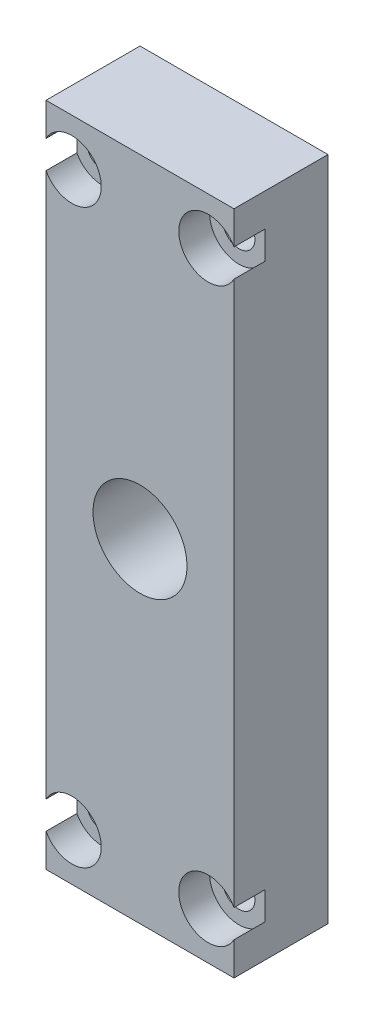
ISO-10303-21;
HEADER;
FILE_DESCRIPTION(('STEP AP214'),'2;1');
FILE_NAME('part.step','',(''),(''),'','','');
FILE_SCHEMA(('AUTOMOTIVE_DESIGN { 1 0 10303 214 1 1 1 1 }'));
ENDSEC;
DATA;
#1=APPLICATION_CONTEXT('core data for automotive mechanical design processes');
#2=APPLICATION_PROTOCOL_DEFINITION('international standard','automotive_design',2000,#1);
#3=PRODUCT_CONTEXT('',#1,'mechanical');
#4=PRODUCT('Part','Part','',(#3));
#5=PRODUCT_RELATED_PRODUCT_CATEGORY('part','',(#4));
#6=PRODUCT_DEFINITION_FORMATION('','',#4);
#7=PRODUCT_DEFINITION_CONTEXT('part definition',#1,'design');
#8=PRODUCT_DEFINITION('design','',#6,#7);
#9=PRODUCT_DEFINITION_SHAPE('','',#8);
#10=(LENGTH_UNIT() NAMED_UNIT(*) SI_UNIT(.MILLI.,.METRE.));
#11=(NAMED_UNIT(*) PLANE_ANGLE_UNIT() SI_UNIT($,.RADIAN.));
#12=(NAMED_UNIT(*) SI_UNIT($,.STERADIAN.) SOLID_ANGLE_UNIT());
#13=UNCERTAINTY_MEASURE_WITH_UNIT(LENGTH_MEASURE(1.E-05),#10,'distance_accuracy_value','');
#14=(GEOMETRIC_REPRESENTATION_CONTEXT(3) GLOBAL_UNCERTAINTY_ASSIGNED_CONTEXT((#13)) GLOBAL_UNIT_ASSIGNED_CONTEXT((#10,
#11,#12)) REPRESENTATION_CONTEXT('',''));
#15=CARTESIAN_POINT('',(0.,0.,0.));
#16=DIRECTION('',(0.,0.,1.));
#17=DIRECTION('',(1.,0.,0.));
#18=AXIS2_PLACEMENT_3D('',#15,#16,#17);
#19=CARTESIAN_POINT('',(0.,90.0176,0.));
#20=DIRECTION('',(0.,0.,-1.));
#21=DIRECTION('',(-1.,0.,0.));
#22=AXIS2_PLACEMENT_3D('',#19,#20,#21);
#23=PLANE('',#22);
#24=CARTESIAN_POINT('',(12.7,45.0127877133106,0.));
#25=DIRECTION('',(0.,0.,1.));
#26=DIRECTION('',(1.,0.,0.));
#27=AXIS2_PLACEMENT_3D('',#24,#25,#26);
#28=CIRCLE('',#27,6.35);
#29=CARTESIAN_POINT('',(19.05,45.0127877133106,0.));
#30=VERTEX_POINT('',#29);
#31=EDGE_CURVE('E241',#30,#30,#28,.T.);
#32=ORIENTED_EDGE('',*,*,#31,.F.);
#33=EDGE_LOOP('',(#32));
#34=FACE_BOUND('',#33,.T.);
#35=CARTESIAN_POINT('',(3.4925,6.35797542662115,0.));
#36=DIRECTION('',(0.,0.,1.));
#37=DIRECTION('',(1.,0.,0.));
#38=AXIS2_PLACEMENT_3D('',#35,#36,#37);
#39=CIRCLE('',#38,3.96875);
#40=CARTESIAN_POINT('',(0.,4.47292362030388,0.));
#41=VERTEX_POINT('',#40);
#42=CARTESIAN_POINT('',(0.,8.24302723293843,0.));
#43=VERTEX_POINT('',#42);
#44=EDGE_CURVE('E127',#41,#43,#39,.T.);
#45=ORIENTED_EDGE('',*,*,#44,.F.);
#46=DIRECTION('',(0.,-1.,0.));
#47=VECTOR('',#46,1.);
#48=CARTESIAN_POINT('',(0.,90.0176,0.));
#49=LINE('',#48,#47);
#50=CARTESIAN_POINT('',(0.,0.,0.));
#51=VERTEX_POINT('',#50);
#52=EDGE_CURVE('E188',#41,#51,#49,.T.);
#53=ORIENTED_EDGE('',*,*,#52,.T.);
#54=DIRECTION('',(1.,0.,0.));
#55=VECTOR('',#54,1.);
#56=CARTESIAN_POINT('',(0.,0.,0.));
#57=LINE('',#56,#55);
#58=CARTESIAN_POINT('',(25.4,0.,0.));
#59=VERTEX_POINT('',#58);
#60=EDGE_CURVE('E206',#51,#59,#57,.T.);
#61=ORIENTED_EDGE('',*,*,#60,.T.);
#62=DIRECTION('',(0.,-1.,0.));
#63=VECTOR('',#62,1.);
#64=CARTESIAN_POINT('',(25.4,90.0176,0.));
#65=LINE('',#64,#63);
#66=CARTESIAN_POINT('',(25.4,4.47292362030389,0.));
#67=VERTEX_POINT('',#66);
#68=EDGE_CURVE('E193',#67,#59,#65,.T.);
#69=ORIENTED_EDGE('',*,*,#68,.F.);
#70=CARTESIAN_POINT('',(21.9075,6.35797542662116,0.));
#71=DIRECTION('',(0.,0.,1.));
#72=DIRECTION('',(1.,0.,0.));
#73=AXIS2_PLACEMENT_3D('',#70,#71,#72);
#74=CIRCLE('',#73,3.96875);
#75=CARTESIAN_POINT('',(25.4,8.24302723293843,0.));
#76=VERTEX_POINT('',#75);
#77=EDGE_CURVE('E233',#76,#67,#74,.T.);
#78=ORIENTED_EDGE('',*,*,#77,.F.);
#79=CARTESIAN_POINT('',(25.4,81.7825481936827,0.));
#80=VERTEX_POINT('',#79);
#81=EDGE_CURVE('E192',#80,#76,#65,.T.);
#82=ORIENTED_EDGE('',*,*,#81,.F.);
#83=CARTESIAN_POINT('',(21.9075,83.6676,0.));
#84=DIRECTION('',(0.,0.,1.));
#85=DIRECTION('',(1.,0.,0.));
#86=AXIS2_PLACEMENT_3D('',#83,#84,#85);
#87=CIRCLE('',#86,3.96875);
#88=CARTESIAN_POINT('',(25.4,85.5526518063173,0.));
#89=VERTEX_POINT('',#88);
#90=EDGE_CURVE('E146',#89,#80,#87,.T.);
#91=ORIENTED_EDGE('',*,*,#90,.F.);
#92=CARTESIAN_POINT('',(25.4,90.0176,0.));
#93=VERTEX_POINT('',#92);
#94=EDGE_CURVE('E189',#93,#89,#65,.T.);
#95=ORIENTED_EDGE('',*,*,#94,.F.);
#96=DIRECTION('',(1.,0.,0.));
#97=VECTOR('',#96,1.);
#98=CARTESIAN_POINT('',(0.,90.0176,0.));
#99=LINE('',#98,#97);
#100=CARTESIAN_POINT('',(0.,90.0176,0.));
#101=VERTEX_POINT('',#100);
#102=EDGE_CURVE('E214',#101,#93,#99,.T.);
#103=ORIENTED_EDGE('',*,*,#102,.F.);
#104=CARTESIAN_POINT('',(0.,85.5526518063173,0.));
#105=VERTEX_POINT('',#104);
#106=EDGE_CURVE('E184',#101,#105,#49,.T.);
#107=ORIENTED_EDGE('',*,*,#106,.T.);
#108=CARTESIAN_POINT('',(3.4925,83.6676,0.));
#109=DIRECTION('',(0.,0.,1.));
#110=DIRECTION('',(1.,0.,0.));
#111=AXIS2_PLACEMENT_3D('',#108,#109,#110);
#112=CIRCLE('',#111,3.96875);
#113=CARTESIAN_POINT('',(0.,81.7825481936827,0.));
#114=VERTEX_POINT('',#113);
#115=EDGE_CURVE('E169',#114,#105,#112,.T.);
#116=ORIENTED_EDGE('',*,*,#115,.F.);
#117=EDGE_CURVE('E187',#114,#43,#49,.T.);
#118=ORIENTED_EDGE('',*,*,#117,.T.);
#119=EDGE_LOOP('',(#45,#53,#61,#69,#78,#82,#91,#95,#103,#107,#116,#118));
#120=FACE_BOUND('',#119,.T.);
#121=ADVANCED_FACE('F38',(#34,#120),#23,.F.);
#122=CARTESIAN_POINT('',(0.,90.0176,0.));
#123=DIRECTION('',(1.,0.,0.));
#124=DIRECTION('',(0.,0.,-1.));
#125=AXIS2_PLACEMENT_3D('',#122,#123,#124);
#126=PLANE('',#125);
#127=DIRECTION('',(0.,1.,0.));
#128=VECTOR('',#127,1.);
#129=CARTESIAN_POINT('',(0.,90.0176,-4.1656));
#130=LINE('',#129,#128);
#131=CARTESIAN_POINT('',(0.,4.47292362030388,-4.1656));
#132=VERTEX_POINT('',#131);
#133=CARTESIAN_POINT('',(0.,8.24302723293843,-4.1656));
#134=VERTEX_POINT('',#133);
#135=EDGE_CURVE('E47',#132,#134,#130,.T.);
#136=ORIENTED_EDGE('',*,*,#135,.T.);
#137=DIRECTION('',(0.,0.,1.));
#138=VECTOR('',#137,1.);
#139=CARTESIAN_POINT('',(0.,8.24302723293843,0.));
#140=LINE('',#139,#138);
#141=EDGE_CURVE('E11',#134,#43,#140,.T.);
#142=ORIENTED_EDGE('',*,*,#141,.T.);
#143=ORIENTED_EDGE('',*,*,#117,.F.);
#144=DIRECTION('',(0.,0.,1.));
#145=VECTOR('',#144,1.);
#146=CARTESIAN_POINT('',(0.,81.7825481936827,0.));
#147=LINE('',#146,#145);
#148=CARTESIAN_POINT('',(0.,81.7825481936827,-4.1656));
#149=VERTEX_POINT('',#148);
#150=EDGE_CURVE('E181',#114,#149,#147,.F.);
#151=ORIENTED_EDGE('',*,*,#150,.T.);
#152=DIRECTION('',(0.,1.,0.));
#153=VECTOR('',#152,1.);
#154=CARTESIAN_POINT('',(0.,90.0176,-4.1656));
#155=LINE('',#154,#153);
#156=CARTESIAN_POINT('',(0.,85.5526518063173,-4.1656));
#157=VERTEX_POINT('',#156);
#158=EDGE_CURVE('E178',#149,#157,#155,.T.);
#159=ORIENTED_EDGE('',*,*,#158,.T.);
#160=DIRECTION('',(0.,0.,1.));
#161=VECTOR('',#160,1.);
#162=CARTESIAN_POINT('',(0.,85.5526518063173,0.));
#163=LINE('',#162,#161);
#164=EDGE_CURVE('E165',#157,#105,#163,.T.);
#165=ORIENTED_EDGE('',*,*,#164,.T.);
#166=ORIENTED_EDGE('',*,*,#106,.F.);
#167=DIRECTION('',(0.,0.,1.));
#168=VECTOR('',#167,1.);
#169=CARTESIAN_POINT('',(0.,90.0176,0.));
#170=LINE('',#169,#168);
#171=CARTESIAN_POINT('',(0.,90.0176,-12.7));
#172=VERTEX_POINT('',#171);
#173=EDGE_CURVE('E203',#172,#101,#170,.T.);
#174=ORIENTED_EDGE('',*,*,#173,.F.);
#175=DIRECTION('',(0.,-1.,0.));
#176=VECTOR('',#175,1.);
#177=CARTESIAN_POINT('',(0.,90.0176,-12.7));
#178=LINE('',#177,#176);
#179=CARTESIAN_POINT('',(0.,0.,-12.7));
#180=VERTEX_POINT('',#179);
#181=EDGE_CURVE('E197',#172,#180,#178,.T.);
#182=ORIENTED_EDGE('',*,*,#181,.T.);
#183=DIRECTION('',(0.,0.,1.));
#184=VECTOR('',#183,1.);
#185=CARTESIAN_POINT('',(0.,0.,0.));
#186=LINE('',#185,#184);
#187=EDGE_CURVE('E174',#180,#51,#186,.T.);
#188=ORIENTED_EDGE('',*,*,#187,.T.);
#189=ORIENTED_EDGE('',*,*,#52,.F.);
#190=DIRECTION('',(0.,0.,1.));
#191=VECTOR('',#190,1.);
#192=CARTESIAN_POINT('',(0.,4.47292362030388,0.));
#193=LINE('',#192,#191);
#194=EDGE_CURVE('E138',#41,#132,#193,.F.);
#195=ORIENTED_EDGE('',*,*,#194,.T.);
#196=EDGE_LOOP('',(#136,#142,#143,#151,#159,#165,#166,#174,#182,#188,#189,#195));
#197=FACE_BOUND('',#196,.T.);
#198=ADVANCED_FACE('F40',(#197),#126,.F.);
#199=CARTESIAN_POINT('',(25.4,90.0176,0.));
#200=DIRECTION('',(-1.,0.,0.));
#201=DIRECTION('',(0.,0.,1.));
#202=AXIS2_PLACEMENT_3D('',#199,#200,#201);
#203=PLANE('',#202);
#204=DIRECTION('',(0.,-1.,0.));
#205=VECTOR('',#204,1.);
#206=CARTESIAN_POINT('',(25.4,90.0176,-4.1656));
#207=LINE('',#206,#205);
#208=CARTESIAN_POINT('',(25.4,8.24302723293843,-4.1656));
#209=VERTEX_POINT('',#208);
#210=CARTESIAN_POINT('',(25.4,4.47292362030389,-4.1656));
#211=VERTEX_POINT('',#210);
#212=EDGE_CURVE('E150',#209,#211,#207,.T.);
#213=ORIENTED_EDGE('',*,*,#212,.T.);
#214=DIRECTION('',(0.,0.,1.));
#215=VECTOR('',#214,1.);
#216=CARTESIAN_POINT('',(25.4,4.47292362030389,0.));
#217=LINE('',#216,#215);
#218=EDGE_CURVE('E140',#211,#67,#217,.T.);
#219=ORIENTED_EDGE('',*,*,#218,.T.);
#220=ORIENTED_EDGE('',*,*,#68,.T.);
#221=DIRECTION('',(0.,0.,-1.));
#222=VECTOR('',#221,1.);
#223=CARTESIAN_POINT('',(25.4,0.,0.));
#224=LINE('',#223,#222);
#225=CARTESIAN_POINT('',(25.4,0.,-12.7));
#226=VERTEX_POINT('',#225);
#227=EDGE_CURVE('E204',#59,#226,#224,.T.);
#228=ORIENTED_EDGE('',*,*,#227,.T.);
#229=DIRECTION('',(0.,-1.,0.));
#230=VECTOR('',#229,1.);
#231=CARTESIAN_POINT('',(25.4,90.0176,-12.7));
#232=LINE('',#231,#230);
#233=CARTESIAN_POINT('',(25.4,90.0176,-12.7));
#234=VERTEX_POINT('',#233);
#235=EDGE_CURVE('E194',#234,#226,#232,.T.);
#236=ORIENTED_EDGE('',*,*,#235,.F.);
#237=DIRECTION('',(0.,0.,-1.));
#238=VECTOR('',#237,1.);
#239=CARTESIAN_POINT('',(25.4,90.0176,0.));
#240=LINE('',#239,#238);
#241=EDGE_CURVE('E212',#93,#234,#240,.T.);
#242=ORIENTED_EDGE('',*,*,#241,.F.);
#243=ORIENTED_EDGE('',*,*,#94,.T.);
#244=DIRECTION('',(0.,0.,1.));
#245=VECTOR('',#244,1.);
#246=CARTESIAN_POINT('',(25.4,85.5526518063173,0.));
#247=LINE('',#246,#245);
#248=CARTESIAN_POINT('',(25.4,85.5526518063173,-4.1656));
#249=VERTEX_POINT('',#248);
#250=EDGE_CURVE('E162',#89,#249,#247,.F.);
#251=ORIENTED_EDGE('',*,*,#250,.T.);
#252=DIRECTION('',(0.,-1.,0.));
#253=VECTOR('',#252,1.);
#254=CARTESIAN_POINT('',(25.4,90.0176,-4.1656));
#255=LINE('',#254,#253);
#256=CARTESIAN_POINT('',(25.4,81.7825481936827,-4.1656));
#257=VERTEX_POINT('',#256);
#258=EDGE_CURVE('E159',#249,#257,#255,.T.);
#259=ORIENTED_EDGE('',*,*,#258,.T.);
#260=DIRECTION('',(0.,0.,1.));
#261=VECTOR('',#260,1.);
#262=CARTESIAN_POINT('',(25.4,81.7825481936827,0.));
#263=LINE('',#262,#261);
#264=EDGE_CURVE('E156',#257,#80,#263,.T.);
#265=ORIENTED_EDGE('',*,*,#264,.T.);
#266=ORIENTED_EDGE('',*,*,#81,.T.);
#267=DIRECTION('',(0.,0.,1.));
#268=VECTOR('',#267,1.);
#269=CARTESIAN_POINT('',(25.4,8.24302723293843,0.));
#270=LINE('',#269,#268);
#271=EDGE_CURVE('E153',#76,#209,#270,.F.);
#272=ORIENTED_EDGE('',*,*,#271,.T.);
#273=EDGE_LOOP('',(#213,#219,#220,#228,#236,#242,#243,#251,#259,#265,#266,#272));
#274=FACE_BOUND('',#273,.T.);
#275=ADVANCED_FACE('F264',(#274),#203,.F.);
#276=CARTESIAN_POINT('',(0.,90.0176,-12.7));
#277=DIRECTION('',(0.,0.,1.));
#278=DIRECTION('',(1.,0.,0.));
#279=AXIS2_PLACEMENT_3D('',#276,#277,#278);
#280=PLANE('',#279);
#281=CARTESIAN_POINT('',(12.7,45.0127877133106,-12.7));
#282=DIRECTION('',(0.,0.,1.));
#283=DIRECTION('',(1.,0.,0.));
#284=AXIS2_PLACEMENT_3D('',#281,#282,#283);
#285=CIRCLE('',#284,6.35);
#286=CARTESIAN_POINT('',(19.05,45.0127877133106,-12.7));
#287=VERTEX_POINT('',#286);
#288=EDGE_CURVE('E238',#287,#287,#285,.T.);
#289=ORIENTED_EDGE('',*,*,#288,.T.);
#290=EDGE_LOOP('',(#289));
#291=FACE_BOUND('',#290,.T.);
#292=CARTESIAN_POINT('',(3.4925,6.35797542662115,-12.7));
#293=DIRECTION('',(0.,0.,1.));
#294=DIRECTION('',(1.,0.,0.));
#295=AXIS2_PLACEMENT_3D('',#292,#293,#294);
#296=CIRCLE('',#295,2.15265);
#297=CARTESIAN_POINT('',(5.64514999999999,6.35797542662115,-12.7));
#298=VERTEX_POINT('',#297);
#299=EDGE_CURVE('E42',#298,#298,#296,.T.);
#300=ORIENTED_EDGE('',*,*,#299,.T.);
#301=EDGE_LOOP('',(#300));
#302=FACE_BOUND('',#301,.T.);
#303=CARTESIAN_POINT('',(21.9075,6.35797542662116,-12.7));
#304=DIRECTION('',(0.,0.,1.));
#305=DIRECTION('',(1.,0.,0.));
#306=AXIS2_PLACEMENT_3D('',#303,#304,#305);
#307=CIRCLE('',#306,2.15265);
#308=CARTESIAN_POINT('',(24.06015,6.35797542662116,-12.7));
#309=VERTEX_POINT('',#308);
#310=EDGE_CURVE('E143',#309,#309,#307,.T.);
#311=ORIENTED_EDGE('',*,*,#310,.T.);
#312=EDGE_LOOP('',(#311));
#313=FACE_BOUND('',#312,.T.);
#314=CARTESIAN_POINT('',(21.9075,83.6676,-12.7));
#315=DIRECTION('',(0.,0.,1.));
#316=DIRECTION('',(1.,0.,0.));
#317=AXIS2_PLACEMENT_3D('',#314,#315,#316);
#318=CIRCLE('',#317,2.15265);
#319=CARTESIAN_POINT('',(24.06015,83.6676,-12.7));
#320=VERTEX_POINT('',#319);
#321=EDGE_CURVE('E166',#320,#320,#318,.T.);
#322=ORIENTED_EDGE('',*,*,#321,.T.);
#323=EDGE_LOOP('',(#322));
#324=FACE_BOUND('',#323,.T.);
#325=CARTESIAN_POINT('',(3.4925,83.6676,-12.7));
#326=DIRECTION('',(0.,0.,1.));
#327=DIRECTION('',(1.,0.,0.));
#328=AXIS2_PLACEMENT_3D('',#325,#326,#327);
#329=CIRCLE('',#328,2.15265);
#330=CARTESIAN_POINT('',(5.64515,83.6676,-12.7));
#331=VERTEX_POINT('',#330);
#332=EDGE_CURVE('E171',#331,#331,#329,.T.);
#333=ORIENTED_EDGE('',*,*,#332,.T.);
#334=EDGE_LOOP('',(#333));
#335=FACE_BOUND('',#334,.T.);
#336=DIRECTION('',(-1.,0.,0.));
#337=VECTOR('',#336,1.);
#338=CARTESIAN_POINT('',(0.,0.,-12.7));
#339=LINE('',#338,#337);
#340=EDGE_CURVE('E201',#226,#180,#339,.T.);
#341=ORIENTED_EDGE('',*,*,#340,.T.);
#342=ORIENTED_EDGE('',*,*,#181,.F.);
#343=DIRECTION('',(-1.,0.,0.));
#344=VECTOR('',#343,1.);
#345=CARTESIAN_POINT('',(0.,90.0176,-12.7));
#346=LINE('',#345,#344);
#347=EDGE_CURVE('E200',#234,#172,#346,.T.);
#348=ORIENTED_EDGE('',*,*,#347,.F.);
#349=ORIENTED_EDGE('',*,*,#235,.T.);
#350=EDGE_LOOP('',(#341,#342,#348,#349));
#351=FACE_BOUND('',#350,.T.);
#352=ADVANCED_FACE('F295',(#291,#302,#313,#324,#335,#351),#280,.F.);
#353=CARTESIAN_POINT('',(0.,90.0176,0.));
#354=DIRECTION('',(0.,-1.,0.));
#355=DIRECTION('',(0.,0.,-1.));
#356=AXIS2_PLACEMENT_3D('',#353,#354,#355);
#357=PLANE('',#356);
#358=ORIENTED_EDGE('',*,*,#173,.T.);
#359=ORIENTED_EDGE('',*,*,#102,.T.);
#360=ORIENTED_EDGE('',*,*,#241,.T.);
#361=ORIENTED_EDGE('',*,*,#347,.T.);
#362=EDGE_LOOP('',(#358,#359,#360,#361));
#363=FACE_BOUND('',#362,.T.);
#364=ADVANCED_FACE('F272',(#363),#357,.F.);
#365=CARTESIAN_POINT('',(0.,0.,0.));
#366=DIRECTION('',(0.,-1.,0.));
#367=DIRECTION('',(0.,0.,-1.));
#368=AXIS2_PLACEMENT_3D('',#365,#366,#367);
#369=PLANE('',#368);
#370=ORIENTED_EDGE('',*,*,#187,.F.);
#371=ORIENTED_EDGE('',*,*,#340,.F.);
#372=ORIENTED_EDGE('',*,*,#227,.F.);
#373=ORIENTED_EDGE('',*,*,#60,.F.);
#374=EDGE_LOOP('',(#370,#371,#372,#373));
#375=FACE_BOUND('',#374,.T.);
#376=ADVANCED_FACE('F257',(#375),#369,.T.);
#377=CARTESIAN_POINT('',(5.64515,83.6676,-4.1656));
#378=DIRECTION('',(0.,0.,-1.));
#379=DIRECTION('',(-1.,0.,0.));
#380=AXIS2_PLACEMENT_3D('',#377,#378,#379);
#381=PLANE('',#380);
#382=CARTESIAN_POINT('',(3.4925,83.6676,-4.1656));
#383=DIRECTION('',(0.,0.,1.));
#384=DIRECTION('',(1.,0.,0.));
#385=AXIS2_PLACEMENT_3D('',#382,#383,#384);
#386=CIRCLE('',#385,2.15265);
#387=CARTESIAN_POINT('',(5.64515,83.6676,-4.1656));
#388=VERTEX_POINT('',#387);
#389=EDGE_CURVE('E175',#388,#388,#386,.T.);
#390=ORIENTED_EDGE('',*,*,#389,.F.);
#391=EDGE_LOOP('',(#390));
#392=FACE_BOUND('',#391,.T.);
#393=CARTESIAN_POINT('',(3.4925,83.6676,-4.1656));
#394=DIRECTION('',(0.,0.,1.));
#395=DIRECTION('',(1.,0.,0.));
#396=AXIS2_PLACEMENT_3D('',#393,#394,#395);
#397=CIRCLE('',#396,3.96875);
#398=EDGE_CURVE('E220',#149,#157,#397,.T.);
#399=ORIENTED_EDGE('',*,*,#398,.T.);
#400=ORIENTED_EDGE('',*,*,#158,.F.);
#401=EDGE_LOOP('',(#399,#400));
#402=FACE_BOUND('',#401,.T.);
#403=ADVANCED_FACE('F278',(#392,#402),#381,.F.);
#404=CARTESIAN_POINT('',(3.4925,83.6676,0.));
#405=DIRECTION('',(0.,0.,1.));
#406=DIRECTION('',(1.,0.,0.));
#407=AXIS2_PLACEMENT_3D('',#404,#405,#406);
#408=CYLINDRICAL_SURFACE('',#407,2.15265);
#409=ORIENTED_EDGE('',*,*,#389,.T.);
#410=EDGE_LOOP('',(#409));
#411=FACE_BOUND('',#410,.T.);
#412=ORIENTED_EDGE('',*,*,#332,.F.);
#413=EDGE_LOOP('',(#412));
#414=FACE_BOUND('',#413,.T.);
#415=ADVANCED_FACE('F280',(#411,#414),#408,.F.);
#416=CARTESIAN_POINT('',(3.4925,83.6676,0.));
#417=DIRECTION('',(0.,0.,1.));
#418=DIRECTION('',(1.,0.,0.));
#419=AXIS2_PLACEMENT_3D('',#416,#417,#418);
#420=CYLINDRICAL_SURFACE('',#419,3.96875);
#421=ORIENTED_EDGE('',*,*,#398,.F.);
#422=ORIENTED_EDGE('',*,*,#150,.F.);
#423=ORIENTED_EDGE('',*,*,#115,.T.);
#424=ORIENTED_EDGE('',*,*,#164,.F.);
#425=EDGE_LOOP('',(#421,#422,#423,#424));
#426=FACE_BOUND('',#425,.T.);
#427=ADVANCED_FACE('F276',(#426),#420,.F.);
#428=CARTESIAN_POINT('',(24.06015,83.6676,-4.1656));
#429=DIRECTION('',(0.,0.,-1.));
#430=DIRECTION('',(-1.,0.,0.));
#431=AXIS2_PLACEMENT_3D('',#428,#429,#430);
#432=PLANE('',#431);
#433=CARTESIAN_POINT('',(21.9075,83.6676,-4.1656));
#434=DIRECTION('',(0.,0.,1.));
#435=DIRECTION('',(1.,0.,0.));
#436=AXIS2_PLACEMENT_3D('',#433,#434,#435);
#437=CIRCLE('',#436,2.15265);
#438=CARTESIAN_POINT('',(24.06015,83.6676,-4.1656));
#439=VERTEX_POINT('',#438);
#440=EDGE_CURVE('E170',#439,#439,#437,.T.);
#441=ORIENTED_EDGE('',*,*,#440,.F.);
#442=EDGE_LOOP('',(#441));
#443=FACE_BOUND('',#442,.T.);
#444=CARTESIAN_POINT('',(21.9075,83.6676,-4.1656));
#445=DIRECTION('',(0.,0.,1.));
#446=DIRECTION('',(1.,0.,0.));
#447=AXIS2_PLACEMENT_3D('',#444,#445,#446);
#448=CIRCLE('',#447,3.96875);
#449=EDGE_CURVE('E226',#249,#257,#448,.T.);
#450=ORIENTED_EDGE('',*,*,#449,.T.);
#451=ORIENTED_EDGE('',*,*,#258,.F.);
#452=EDGE_LOOP('',(#450,#451));
#453=FACE_BOUND('',#452,.T.);
#454=ADVANCED_FACE('F389',(#443,#453),#432,.F.);
#455=CARTESIAN_POINT('',(21.9075,83.6676,0.));
#456=DIRECTION('',(0.,0.,1.));
#457=DIRECTION('',(1.,0.,0.));
#458=AXIS2_PLACEMENT_3D('',#455,#456,#457);
#459=CYLINDRICAL_SURFACE('',#458,3.96875);
#460=ORIENTED_EDGE('',*,*,#449,.F.);
#461=ORIENTED_EDGE('',*,*,#250,.F.);
#462=ORIENTED_EDGE('',*,*,#90,.T.);
#463=ORIENTED_EDGE('',*,*,#264,.F.);
#464=EDGE_LOOP('',(#460,#461,#462,#463));
#465=FACE_BOUND('',#464,.T.);
#466=ADVANCED_FACE('F382',(#465),#459,.F.);
#467=CARTESIAN_POINT('',(21.9075,83.6676,0.));
#468=DIRECTION('',(0.,0.,1.));
#469=DIRECTION('',(1.,0.,0.));
#470=AXIS2_PLACEMENT_3D('',#467,#468,#469);
#471=CYLINDRICAL_SURFACE('',#470,2.15265);
#472=ORIENTED_EDGE('',*,*,#440,.T.);
#473=EDGE_LOOP('',(#472));
#474=FACE_BOUND('',#473,.T.);
#475=ORIENTED_EDGE('',*,*,#321,.F.);
#476=EDGE_LOOP('',(#475));
#477=FACE_BOUND('',#476,.T.);
#478=ADVANCED_FACE('F374',(#474,#477),#471,.F.);
#479=CARTESIAN_POINT('',(21.9075,6.35797542662116,0.));
#480=DIRECTION('',(0.,0.,1.));
#481=DIRECTION('',(1.,0.,0.));
#482=AXIS2_PLACEMENT_3D('',#479,#480,#481);
#483=CYLINDRICAL_SURFACE('',#482,2.15265);
#484=CARTESIAN_POINT('',(21.9075,6.35797542662116,-4.1656));
#485=DIRECTION('',(0.,0.,1.));
#486=DIRECTION('',(1.,0.,0.));
#487=AXIS2_PLACEMENT_3D('',#484,#485,#486);
#488=CIRCLE('',#487,2.15265);
#489=CARTESIAN_POINT('',(24.06015,6.35797542662116,-4.1656));
#490=VERTEX_POINT('',#489);
#491=EDGE_CURVE('E147',#490,#490,#488,.T.);
#492=ORIENTED_EDGE('',*,*,#491,.T.);
#493=EDGE_LOOP('',(#492));
#494=FACE_BOUND('',#493,.T.);
#495=ORIENTED_EDGE('',*,*,#310,.F.);
#496=EDGE_LOOP('',(#495));
#497=FACE_BOUND('',#496,.T.);
#498=ADVANCED_FACE('F366',(#494,#497),#483,.F.);
#499=CARTESIAN_POINT('',(24.06015,6.35797542662116,-4.1656));
#500=DIRECTION('',(0.,0.,-1.));
#501=DIRECTION('',(-1.,0.,0.));
#502=AXIS2_PLACEMENT_3D('',#499,#500,#501);
#503=PLANE('',#502);
#504=ORIENTED_EDGE('',*,*,#491,.F.);
#505=EDGE_LOOP('',(#504));
#506=FACE_BOUND('',#505,.T.);
#507=CARTESIAN_POINT('',(21.9075,6.35797542662116,-4.1656));
#508=DIRECTION('',(0.,0.,1.));
#509=DIRECTION('',(1.,0.,0.));
#510=AXIS2_PLACEMENT_3D('',#507,#508,#509);
#511=CIRCLE('',#510,3.96875);
#512=EDGE_CURVE('E62',#209,#211,#511,.T.);
#513=ORIENTED_EDGE('',*,*,#512,.T.);
#514=ORIENTED_EDGE('',*,*,#212,.F.);
#515=EDGE_LOOP('',(#513,#514));
#516=FACE_BOUND('',#515,.T.);
#517=ADVANCED_FACE('F359',(#506,#516),#503,.F.);
#518=CARTESIAN_POINT('',(21.9075,6.35797542662116,0.));
#519=DIRECTION('',(0.,0.,1.));
#520=DIRECTION('',(1.,0.,0.));
#521=AXIS2_PLACEMENT_3D('',#518,#519,#520);
#522=CYLINDRICAL_SURFACE('',#521,3.96875);
#523=ORIENTED_EDGE('',*,*,#512,.F.);
#524=ORIENTED_EDGE('',*,*,#271,.F.);
#525=ORIENTED_EDGE('',*,*,#77,.T.);
#526=ORIENTED_EDGE('',*,*,#218,.F.);
#527=EDGE_LOOP('',(#523,#524,#525,#526));
#528=FACE_BOUND('',#527,.T.);
#529=ADVANCED_FACE('F351',(#528),#522,.F.);
#530=CARTESIAN_POINT('',(5.64514999999999,6.35797542662115,-4.1656));
#531=DIRECTION('',(0.,0.,-1.));
#532=DIRECTION('',(-1.,0.,0.));
#533=AXIS2_PLACEMENT_3D('',#530,#531,#532);
#534=PLANE('',#533);
#535=CARTESIAN_POINT('',(3.4925,6.35797542662115,-4.1656));
#536=DIRECTION('',(0.,0.,1.));
#537=DIRECTION('',(1.,0.,0.));
#538=AXIS2_PLACEMENT_3D('',#535,#536,#537);
#539=CIRCLE('',#538,2.15265);
#540=CARTESIAN_POINT('',(5.64514999999999,6.35797542662115,-4.1656));
#541=VERTEX_POINT('',#540);
#542=EDGE_CURVE('E135',#541,#541,#539,.T.);
#543=ORIENTED_EDGE('',*,*,#542,.F.);
#544=EDGE_LOOP('',(#543));
#545=FACE_BOUND('',#544,.T.);
#546=CARTESIAN_POINT('',(3.4925,6.35797542662115,-4.1656));
#547=DIRECTION('',(0.,0.,1.));
#548=DIRECTION('',(1.,0.,0.));
#549=AXIS2_PLACEMENT_3D('',#546,#547,#548);
#550=CIRCLE('',#549,3.96875);
#551=EDGE_CURVE('E54',#132,#134,#550,.T.);
#552=ORIENTED_EDGE('',*,*,#551,.T.);
#553=ORIENTED_EDGE('',*,*,#135,.F.);
#554=EDGE_LOOP('',(#552,#553));
#555=FACE_BOUND('',#554,.T.);
#556=ADVANCED_FACE('F133',(#545,#555),#534,.F.);
#557=CARTESIAN_POINT('',(3.4925,6.35797542662115,0.));
#558=DIRECTION('',(0.,0.,1.));
#559=DIRECTION('',(1.,0.,0.));
#560=AXIS2_PLACEMENT_3D('',#557,#558,#559);
#561=CYLINDRICAL_SURFACE('',#560,2.15265);
#562=ORIENTED_EDGE('',*,*,#542,.T.);
#563=EDGE_LOOP('',(#562));
#564=FACE_BOUND('',#563,.T.);
#565=ORIENTED_EDGE('',*,*,#299,.F.);
#566=EDGE_LOOP('',(#565));
#567=FACE_BOUND('',#566,.T.);
#568=ADVANCED_FACE('F340',(#564,#567),#561,.F.);
#569=CARTESIAN_POINT('',(3.4925,6.35797542662115,0.));
#570=DIRECTION('',(0.,0.,1.));
#571=DIRECTION('',(1.,0.,0.));
#572=AXIS2_PLACEMENT_3D('',#569,#570,#571);
#573=CYLINDRICAL_SURFACE('',#572,3.96875);
#574=ORIENTED_EDGE('',*,*,#551,.F.);
#575=ORIENTED_EDGE('',*,*,#194,.F.);
#576=ORIENTED_EDGE('',*,*,#44,.T.);
#577=ORIENTED_EDGE('',*,*,#141,.F.);
#578=EDGE_LOOP('',(#574,#575,#576,#577));
#579=FACE_BOUND('',#578,.T.);
#580=ADVANCED_FACE('F125',(#579),#573,.F.);
#581=CARTESIAN_POINT('',(12.7,45.0127877133106,0.));
#582=DIRECTION('',(0.,0.,1.));
#583=DIRECTION('',(1.,0.,0.));
#584=AXIS2_PLACEMENT_3D('',#581,#582,#583);
#585=CYLINDRICAL_SURFACE('',#584,6.35);
#586=ORIENTED_EDGE('',*,*,#31,.T.);
#587=EDGE_LOOP('',(#586));
#588=FACE_BOUND('',#587,.T.);
#589=ORIENTED_EDGE('',*,*,#288,.F.);
#590=EDGE_LOOP('',(#589));
#591=FACE_BOUND('',#590,.T.);
#592=ADVANCED_FACE('F245',(#588,#591),#585,.F.);
#593=CLOSED_SHELL('',(#121,#198,#275,#352,#364,#376,#403,#415,#427,#454,#466,#478,#498,#517,
#529,#556,#568,#580,#592));
#594=MANIFOLD_SOLID_BREP('B2',#593);
#595=ADVANCED_BREP_SHAPE_REPRESENTATION('',(#18,#594),#14);
#596=SHAPE_DEFINITION_REPRESENTATION(#9,#595);
ENDSEC;
END-ISO-10303-21;
